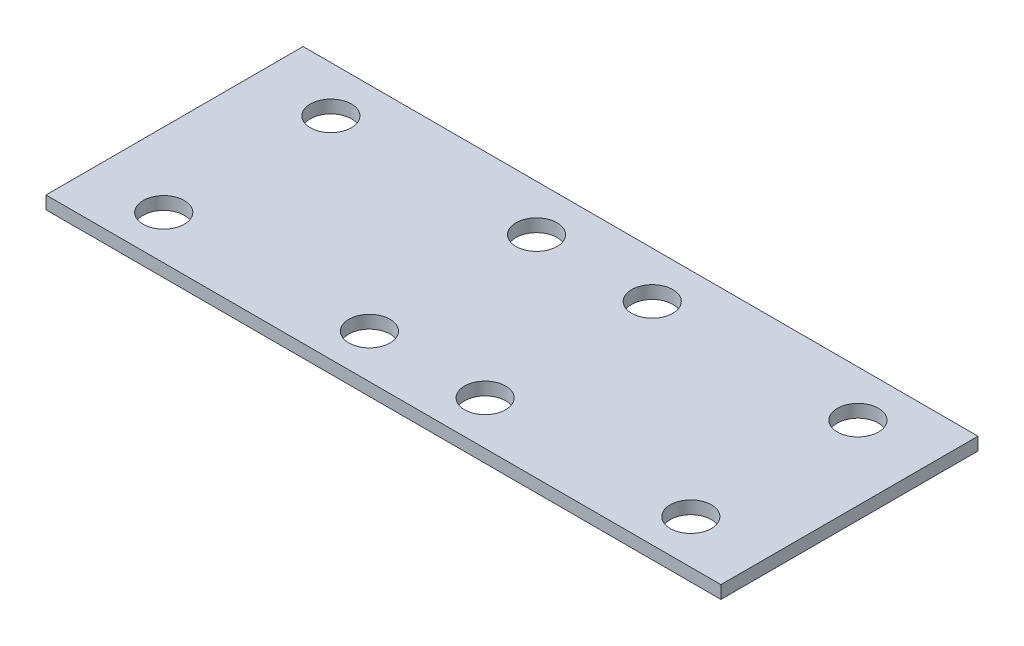
ISO-10303-21;
HEADER;
FILE_DESCRIPTION(('STEP AP214'),'2;1');
FILE_NAME('part.step','',(''),(''),'','','');
FILE_SCHEMA(('AUTOMOTIVE_DESIGN { 1 0 10303 214 1 1 1 1 }'));
ENDSEC;
DATA;
#1=APPLICATION_CONTEXT('core data for automotive mechanical design processes');
#2=APPLICATION_PROTOCOL_DEFINITION('international standard','automotive_design',2000,#1);
#3=PRODUCT_CONTEXT('',#1,'mechanical');
#4=PRODUCT('Part','Part','',(#3));
#5=PRODUCT_RELATED_PRODUCT_CATEGORY('part','',(#4));
#6=PRODUCT_DEFINITION_FORMATION('','',#4);
#7=PRODUCT_DEFINITION_CONTEXT('part definition',#1,'design');
#8=PRODUCT_DEFINITION('design','',#6,#7);
#9=PRODUCT_DEFINITION_SHAPE('','',#8);
#10=(LENGTH_UNIT() NAMED_UNIT(*) SI_UNIT(.MILLI.,.METRE.));
#11=(NAMED_UNIT(*) PLANE_ANGLE_UNIT() SI_UNIT($,.RADIAN.));
#12=(NAMED_UNIT(*) SI_UNIT($,.STERADIAN.) SOLID_ANGLE_UNIT());
#13=UNCERTAINTY_MEASURE_WITH_UNIT(LENGTH_MEASURE(1.E-05),#10,'distance_accuracy_value','');
#14=(GEOMETRIC_REPRESENTATION_CONTEXT(3) GLOBAL_UNCERTAINTY_ASSIGNED_CONTEXT((#13)) GLOBAL_UNIT_ASSIGNED_CONTEXT((#10,
#11,#12)) REPRESENTATION_CONTEXT('',''));
#15=CARTESIAN_POINT('',(0.,0.,0.));
#16=DIRECTION('',(0.,0.,1.));
#17=DIRECTION('',(1.,0.,0.));
#18=AXIS2_PLACEMENT_3D('',#15,#16,#17);
#19=CARTESIAN_POINT('',(26.25,1.,10.));
#20=DIRECTION('',(-1.,0.,0.));
#21=DIRECTION('',(0.,0.,1.));
#22=AXIS2_PLACEMENT_3D('',#19,#20,#21);
#23=PLANE('',#22);
#24=DIRECTION('',(0.,0.,-1.));
#25=VECTOR('',#24,1.);
#26=CARTESIAN_POINT('',(26.25,0.,10.));
#27=LINE('',#26,#25);
#28=CARTESIAN_POINT('',(26.25,0.,10.));
#29=VERTEX_POINT('',#28);
#30=CARTESIAN_POINT('',(26.25,0.,-10.));
#31=VERTEX_POINT('',#30);
#32=EDGE_CURVE('E110',#29,#31,#27,.T.);
#33=ORIENTED_EDGE('',*,*,#32,.T.);
#34=DIRECTION('',(0.,-1.,0.));
#35=VECTOR('',#34,1.);
#36=CARTESIAN_POINT('',(26.25,1.,-10.));
#37=LINE('',#36,#35);
#38=CARTESIAN_POINT('',(26.25,1.,-10.));
#39=VERTEX_POINT('',#38);
#40=EDGE_CURVE('E11',#39,#31,#37,.T.);
#41=ORIENTED_EDGE('',*,*,#40,.F.);
#42=DIRECTION('',(0.,0.,-1.));
#43=VECTOR('',#42,1.);
#44=CARTESIAN_POINT('',(26.25,1.,10.));
#45=LINE('',#44,#43);
#46=CARTESIAN_POINT('',(26.25,1.,10.));
#47=VERTEX_POINT('',#46);
#48=EDGE_CURVE('E93',#47,#39,#45,.T.);
#49=ORIENTED_EDGE('',*,*,#48,.F.);
#50=DIRECTION('',(0.,-1.,0.));
#51=VECTOR('',#50,1.);
#52=CARTESIAN_POINT('',(26.25,1.,10.));
#53=LINE('',#52,#51);
#54=EDGE_CURVE('E106',#47,#29,#53,.T.);
#55=ORIENTED_EDGE('',*,*,#54,.T.);
#56=EDGE_LOOP('',(#33,#41,#49,#55));
#57=FACE_BOUND('',#56,.T.);
#58=ADVANCED_FACE('F39',(#57),#23,.F.);
#59=CARTESIAN_POINT('',(-26.25,1.,-10.));
#60=DIRECTION('',(0.,0.,1.));
#61=DIRECTION('',(1.,0.,0.));
#62=AXIS2_PLACEMENT_3D('',#59,#60,#61);
#63=PLANE('',#62);
#64=DIRECTION('',(-1.,0.,0.));
#65=VECTOR('',#64,1.);
#66=CARTESIAN_POINT('',(-26.25,0.,-10.));
#67=LINE('',#66,#65);
#68=CARTESIAN_POINT('',(-26.25,0.,-10.));
#69=VERTEX_POINT('',#68);
#70=EDGE_CURVE('E98',#31,#69,#67,.T.);
#71=ORIENTED_EDGE('',*,*,#70,.T.);
#72=DIRECTION('',(0.,-1.,0.));
#73=VECTOR('',#72,1.);
#74=CARTESIAN_POINT('',(-26.25,1.,-10.));
#75=LINE('',#74,#73);
#76=CARTESIAN_POINT('',(-26.25,1.,-10.));
#77=VERTEX_POINT('',#76);
#78=EDGE_CURVE('E49',#77,#69,#75,.T.);
#79=ORIENTED_EDGE('',*,*,#78,.F.);
#80=DIRECTION('',(-1.,0.,0.));
#81=VECTOR('',#80,1.);
#82=CARTESIAN_POINT('',(-26.25,1.,-10.));
#83=LINE('',#82,#81);
#84=EDGE_CURVE('E88',#39,#77,#83,.T.);
#85=ORIENTED_EDGE('',*,*,#84,.F.);
#86=ORIENTED_EDGE('',*,*,#40,.T.);
#87=EDGE_LOOP('',(#71,#79,#85,#86));
#88=FACE_BOUND('',#87,.T.);
#89=ADVANCED_FACE('F97',(#88),#63,.F.);
#90=CARTESIAN_POINT('',(-26.25,1.,10.));
#91=DIRECTION('',(1.,0.,0.));
#92=DIRECTION('',(0.,0.,-1.));
#93=AXIS2_PLACEMENT_3D('',#90,#91,#92);
#94=PLANE('',#93);
#95=DIRECTION('',(0.,0.,1.));
#96=VECTOR('',#95,1.);
#97=CARTESIAN_POINT('',(-26.25,0.,10.));
#98=LINE('',#97,#96);
#99=CARTESIAN_POINT('',(-26.25,0.,10.));
#100=VERTEX_POINT('',#99);
#101=EDGE_CURVE('E75',#69,#100,#98,.T.);
#102=ORIENTED_EDGE('',*,*,#101,.T.);
#103=DIRECTION('',(0.,-1.,0.));
#104=VECTOR('',#103,1.);
#105=CARTESIAN_POINT('',(-26.25,1.,10.));
#106=LINE('',#105,#104);
#107=CARTESIAN_POINT('',(-26.25,1.,10.));
#108=VERTEX_POINT('',#107);
#109=EDGE_CURVE('E100',#108,#100,#106,.T.);
#110=ORIENTED_EDGE('',*,*,#109,.F.);
#111=DIRECTION('',(0.,0.,1.));
#112=VECTOR('',#111,1.);
#113=CARTESIAN_POINT('',(-26.25,1.,10.));
#114=LINE('',#113,#112);
#115=EDGE_CURVE('E91',#77,#108,#114,.T.);
#116=ORIENTED_EDGE('',*,*,#115,.F.);
#117=ORIENTED_EDGE('',*,*,#78,.T.);
#118=EDGE_LOOP('',(#102,#110,#116,#117));
#119=FACE_BOUND('',#118,.T.);
#120=ADVANCED_FACE('F102',(#119),#94,.F.);
#121=CARTESIAN_POINT('',(-26.25,1.,10.));
#122=DIRECTION('',(0.,0.,-1.));
#123=DIRECTION('',(-1.,0.,0.));
#124=AXIS2_PLACEMENT_3D('',#121,#122,#123);
#125=PLANE('',#124);
#126=DIRECTION('',(1.,0.,0.));
#127=VECTOR('',#126,1.);
#128=CARTESIAN_POINT('',(-26.25,0.,10.));
#129=LINE('',#128,#127);
#130=EDGE_CURVE('E81',#100,#29,#129,.T.);
#131=ORIENTED_EDGE('',*,*,#130,.T.);
#132=ORIENTED_EDGE('',*,*,#54,.F.);
#133=DIRECTION('',(1.,0.,0.));
#134=VECTOR('',#133,1.);
#135=CARTESIAN_POINT('',(-26.25,1.,10.));
#136=LINE('',#135,#134);
#137=EDGE_CURVE('E58',#108,#47,#136,.T.);
#138=ORIENTED_EDGE('',*,*,#137,.F.);
#139=ORIENTED_EDGE('',*,*,#109,.T.);
#140=EDGE_LOOP('',(#131,#132,#138,#139));
#141=FACE_BOUND('',#140,.T.);
#142=ADVANCED_FACE('F180',(#141),#125,.F.);
#143=CARTESIAN_POINT('',(0.,1.,0.));
#144=DIRECTION('',(0.,-1.,0.));
#145=DIRECTION('',(0.,0.,-1.));
#146=AXIS2_PLACEMENT_3D('',#143,#144,#145);
#147=PLANE('',#146);
#148=CARTESIAN_POINT('',(-20.5,1.,6.59090710382514));
#149=DIRECTION('',(0.,1.,0.));
#150=DIRECTION('',(0.,0.,1.));
#151=AXIS2_PLACEMENT_3D('',#148,#149,#150);
#152=CIRCLE('',#151,1.6);
#153=CARTESIAN_POINT('',(-20.5,1.,8.19090710382514));
#154=VERTEX_POINT('',#153);
#155=EDGE_CURVE('E303',#154,#154,#152,.T.);
#156=ORIENTED_EDGE('',*,*,#155,.F.);
#157=EDGE_LOOP('',(#156));
#158=FACE_BOUND('',#157,.T.);
#159=CARTESIAN_POINT('',(20.5,1.,-6.40909289617486));
#160=DIRECTION('',(0.,1.,0.));
#161=DIRECTION('',(0.,0.,1.));
#162=AXIS2_PLACEMENT_3D('',#159,#160,#161);
#163=CIRCLE('',#162,1.6);
#164=CARTESIAN_POINT('',(20.5,1.,-4.80909289617486));
#165=VERTEX_POINT('',#164);
#166=EDGE_CURVE('E299',#165,#165,#163,.T.);
#167=ORIENTED_EDGE('',*,*,#166,.F.);
#168=EDGE_LOOP('',(#167));
#169=FACE_BOUND('',#168,.T.);
#170=CARTESIAN_POINT('',(4.5,1.,-6.40909289617486));
#171=DIRECTION('',(0.,1.,0.));
#172=DIRECTION('',(0.,0.,1.));
#173=AXIS2_PLACEMENT_3D('',#170,#171,#172);
#174=CIRCLE('',#173,1.6);
#175=CARTESIAN_POINT('',(4.5,1.,-4.80909289617486));
#176=VERTEX_POINT('',#175);
#177=EDGE_CURVE('E302',#176,#176,#174,.T.);
#178=ORIENTED_EDGE('',*,*,#177,.F.);
#179=EDGE_LOOP('',(#178));
#180=FACE_BOUND('',#179,.T.);
#181=CARTESIAN_POINT('',(-4.5,1.,-6.40909289617486));
#182=DIRECTION('',(0.,1.,0.));
#183=DIRECTION('',(0.,0.,1.));
#184=AXIS2_PLACEMENT_3D('',#181,#182,#183);
#185=CIRCLE('',#184,1.6);
#186=CARTESIAN_POINT('',(-4.5,1.,-4.80909289617486));
#187=VERTEX_POINT('',#186);
#188=EDGE_CURVE('E308',#187,#187,#185,.T.);
#189=ORIENTED_EDGE('',*,*,#188,.F.);
#190=EDGE_LOOP('',(#189));
#191=FACE_BOUND('',#190,.T.);
#192=CARTESIAN_POINT('',(-4.5,1.,6.59090710382514));
#193=DIRECTION('',(0.,1.,0.));
#194=DIRECTION('',(0.,0.,1.));
#195=AXIS2_PLACEMENT_3D('',#192,#193,#194);
#196=CIRCLE('',#195,1.6);
#197=CARTESIAN_POINT('',(-4.5,1.,8.19090710382514));
#198=VERTEX_POINT('',#197);
#199=EDGE_CURVE('E311',#198,#198,#196,.T.);
#200=ORIENTED_EDGE('',*,*,#199,.F.);
#201=EDGE_LOOP('',(#200));
#202=FACE_BOUND('',#201,.T.);
#203=CARTESIAN_POINT('',(4.5,1.,6.59090710382514));
#204=DIRECTION('',(0.,1.,0.));
#205=DIRECTION('',(0.,0.,1.));
#206=AXIS2_PLACEMENT_3D('',#203,#204,#205);
#207=CIRCLE('',#206,1.6);
#208=CARTESIAN_POINT('',(4.5,1.,8.19090710382514));
#209=VERTEX_POINT('',#208);
#210=EDGE_CURVE('E336',#209,#209,#207,.T.);
#211=ORIENTED_EDGE('',*,*,#210,.F.);
#212=EDGE_LOOP('',(#211));
#213=FACE_BOUND('',#212,.T.);
#214=CARTESIAN_POINT('',(20.5,1.,6.59090710382514));
#215=DIRECTION('',(0.,1.,0.));
#216=DIRECTION('',(0.,0.,1.));
#217=AXIS2_PLACEMENT_3D('',#214,#215,#216);
#218=CIRCLE('',#217,1.6);
#219=CARTESIAN_POINT('',(20.5,1.,8.19090710382514));
#220=VERTEX_POINT('',#219);
#221=EDGE_CURVE('E314',#220,#220,#218,.T.);
#222=ORIENTED_EDGE('',*,*,#221,.F.);
#223=EDGE_LOOP('',(#222));
#224=FACE_BOUND('',#223,.T.);
#225=CARTESIAN_POINT('',(-20.5,1.,-6.40909289617486));
#226=DIRECTION('',(0.,1.,0.));
#227=DIRECTION('',(0.,0.,1.));
#228=AXIS2_PLACEMENT_3D('',#225,#226,#227);
#229=CIRCLE('',#228,1.6);
#230=CARTESIAN_POINT('',(-20.5,1.,-4.80909289617486));
#231=VERTEX_POINT('',#230);
#232=EDGE_CURVE('E129',#231,#231,#229,.T.);
#233=ORIENTED_EDGE('',*,*,#232,.F.);
#234=EDGE_LOOP('',(#233));
#235=FACE_BOUND('',#234,.T.);
#236=ORIENTED_EDGE('',*,*,#48,.T.);
#237=ORIENTED_EDGE('',*,*,#84,.T.);
#238=ORIENTED_EDGE('',*,*,#115,.T.);
#239=ORIENTED_EDGE('',*,*,#137,.T.);
#240=EDGE_LOOP('',(#236,#237,#238,#239));
#241=FACE_BOUND('',#240,.T.);
#242=ADVANCED_FACE('F89',(#158,#169,#180,#191,#202,#213,#224,#235,#241),#147,.F.);
#243=CARTESIAN_POINT('',(0.,0.,0.));
#244=DIRECTION('',(0.,-1.,0.));
#245=DIRECTION('',(0.,0.,-1.));
#246=AXIS2_PLACEMENT_3D('',#243,#244,#245);
#247=PLANE('',#246);
#248=CARTESIAN_POINT('',(-20.5,0.,6.59090710382514));
#249=DIRECTION('',(0.,-1.,0.));
#250=DIRECTION('',(0.,0.,-1.));
#251=AXIS2_PLACEMENT_3D('',#248,#249,#250);
#252=CIRCLE('',#251,1.6);
#253=CARTESIAN_POINT('',(-20.5,0.,4.99090710382514));
#254=VERTEX_POINT('',#253);
#255=EDGE_CURVE('E42',#254,#254,#252,.T.);
#256=ORIENTED_EDGE('',*,*,#255,.F.);
#257=EDGE_LOOP('',(#256));
#258=FACE_BOUND('',#257,.T.);
#259=CARTESIAN_POINT('',(20.5,0.,-6.40909289617486));
#260=DIRECTION('',(0.,-1.,0.));
#261=DIRECTION('',(0.,0.,-1.));
#262=AXIS2_PLACEMENT_3D('',#259,#260,#261);
#263=CIRCLE('',#262,1.6);
#264=CARTESIAN_POINT('',(20.5,0.,-8.00909289617486));
#265=VERTEX_POINT('',#264);
#266=EDGE_CURVE('E148',#265,#265,#263,.T.);
#267=ORIENTED_EDGE('',*,*,#266,.F.);
#268=EDGE_LOOP('',(#267));
#269=FACE_BOUND('',#268,.T.);
#270=CARTESIAN_POINT('',(4.5,0.,-6.40909289617486));
#271=DIRECTION('',(0.,-1.,0.));
#272=DIRECTION('',(0.,0.,-1.));
#273=AXIS2_PLACEMENT_3D('',#270,#271,#272);
#274=CIRCLE('',#273,1.6);
#275=CARTESIAN_POINT('',(4.5,0.,-8.00909289617486));
#276=VERTEX_POINT('',#275);
#277=EDGE_CURVE('E145',#276,#276,#274,.T.);
#278=ORIENTED_EDGE('',*,*,#277,.F.);
#279=EDGE_LOOP('',(#278));
#280=FACE_BOUND('',#279,.T.);
#281=CARTESIAN_POINT('',(-4.5,0.,-6.40909289617486));
#282=DIRECTION('',(0.,-1.,0.));
#283=DIRECTION('',(0.,0.,-1.));
#284=AXIS2_PLACEMENT_3D('',#281,#282,#283);
#285=CIRCLE('',#284,1.6);
#286=CARTESIAN_POINT('',(-4.5,0.,-8.00909289617486));
#287=VERTEX_POINT('',#286);
#288=EDGE_CURVE('E141',#287,#287,#285,.T.);
#289=ORIENTED_EDGE('',*,*,#288,.F.);
#290=EDGE_LOOP('',(#289));
#291=FACE_BOUND('',#290,.T.);
#292=CARTESIAN_POINT('',(-4.5,0.,6.59090710382514));
#293=DIRECTION('',(0.,-1.,0.));
#294=DIRECTION('',(0.,0.,-1.));
#295=AXIS2_PLACEMENT_3D('',#292,#293,#294);
#296=CIRCLE('',#295,1.6);
#297=CARTESIAN_POINT('',(-4.5,0.,4.99090710382514));
#298=VERTEX_POINT('',#297);
#299=EDGE_CURVE('E137',#298,#298,#296,.T.);
#300=ORIENTED_EDGE('',*,*,#299,.F.);
#301=EDGE_LOOP('',(#300));
#302=FACE_BOUND('',#301,.T.);
#303=CARTESIAN_POINT('',(4.5,0.,6.59090710382514));
#304=DIRECTION('',(0.,-1.,0.));
#305=DIRECTION('',(0.,0.,-1.));
#306=AXIS2_PLACEMENT_3D('',#303,#304,#305);
#307=CIRCLE('',#306,1.6);
#308=CARTESIAN_POINT('',(4.5,0.,4.99090710382514));
#309=VERTEX_POINT('',#308);
#310=EDGE_CURVE('E133',#309,#309,#307,.T.);
#311=ORIENTED_EDGE('',*,*,#310,.F.);
#312=EDGE_LOOP('',(#311));
#313=FACE_BOUND('',#312,.T.);
#314=CARTESIAN_POINT('',(20.5,0.,6.59090710382514));
#315=DIRECTION('',(0.,-1.,0.));
#316=DIRECTION('',(0.,0.,-1.));
#317=AXIS2_PLACEMENT_3D('',#314,#315,#316);
#318=CIRCLE('',#317,1.6);
#319=CARTESIAN_POINT('',(20.5,0.,4.99090710382514));
#320=VERTEX_POINT('',#319);
#321=EDGE_CURVE('E128',#320,#320,#318,.T.);
#322=ORIENTED_EDGE('',*,*,#321,.F.);
#323=EDGE_LOOP('',(#322));
#324=FACE_BOUND('',#323,.T.);
#325=CARTESIAN_POINT('',(-20.5,0.,-6.40909289617486));
#326=DIRECTION('',(0.,-1.,0.));
#327=DIRECTION('',(0.,0.,-1.));
#328=AXIS2_PLACEMENT_3D('',#325,#326,#327);
#329=CIRCLE('',#328,1.6);
#330=CARTESIAN_POINT('',(-20.5,0.,-8.00909289617486));
#331=VERTEX_POINT('',#330);
#332=EDGE_CURVE('E124',#331,#331,#329,.T.);
#333=ORIENTED_EDGE('',*,*,#332,.F.);
#334=EDGE_LOOP('',(#333));
#335=FACE_BOUND('',#334,.T.);
#336=ORIENTED_EDGE('',*,*,#32,.F.);
#337=ORIENTED_EDGE('',*,*,#130,.F.);
#338=ORIENTED_EDGE('',*,*,#101,.F.);
#339=ORIENTED_EDGE('',*,*,#70,.F.);
#340=EDGE_LOOP('',(#336,#337,#338,#339));
#341=FACE_BOUND('',#340,.T.);
#342=ADVANCED_FACE('F160',(#258,#269,#280,#291,#302,#313,#324,#335,#341),#247,.T.);
#343=CARTESIAN_POINT('',(-20.5,-1.,-6.40909289617486));
#344=DIRECTION('',(0.,1.,0.));
#345=DIRECTION('',(0.,0.,1.));
#346=AXIS2_PLACEMENT_3D('',#343,#344,#345);
#347=CYLINDRICAL_SURFACE('',#346,1.6);
#348=ORIENTED_EDGE('',*,*,#332,.T.);
#349=EDGE_LOOP('',(#348));
#350=FACE_BOUND('',#349,.T.);
#351=ORIENTED_EDGE('',*,*,#232,.T.);
#352=EDGE_LOOP('',(#351));
#353=FACE_BOUND('',#352,.T.);
#354=ADVANCED_FACE('F163',(#350,#353),#347,.F.);
#355=CARTESIAN_POINT('',(20.5,-1.,6.59090710382514));
#356=DIRECTION('',(0.,1.,0.));
#357=DIRECTION('',(0.,0.,1.));
#358=AXIS2_PLACEMENT_3D('',#355,#356,#357);
#359=CYLINDRICAL_SURFACE('',#358,1.6);
#360=ORIENTED_EDGE('',*,*,#321,.T.);
#361=EDGE_LOOP('',(#360));
#362=FACE_BOUND('',#361,.T.);
#363=ORIENTED_EDGE('',*,*,#221,.T.);
#364=EDGE_LOOP('',(#363));
#365=FACE_BOUND('',#364,.T.);
#366=ADVANCED_FACE('F225',(#362,#365),#359,.F.);
#367=CARTESIAN_POINT('',(4.5,-1.,6.59090710382514));
#368=DIRECTION('',(0.,1.,0.));
#369=DIRECTION('',(0.,0.,1.));
#370=AXIS2_PLACEMENT_3D('',#367,#368,#369);
#371=CYLINDRICAL_SURFACE('',#370,1.6);
#372=ORIENTED_EDGE('',*,*,#310,.T.);
#373=EDGE_LOOP('',(#372));
#374=FACE_BOUND('',#373,.T.);
#375=ORIENTED_EDGE('',*,*,#210,.T.);
#376=EDGE_LOOP('',(#375));
#377=FACE_BOUND('',#376,.T.);
#378=ADVANCED_FACE('F235',(#374,#377),#371,.F.);
#379=CARTESIAN_POINT('',(-4.5,-1.,6.59090710382514));
#380=DIRECTION('',(0.,1.,0.));
#381=DIRECTION('',(0.,0.,1.));
#382=AXIS2_PLACEMENT_3D('',#379,#380,#381);
#383=CYLINDRICAL_SURFACE('',#382,1.6);
#384=ORIENTED_EDGE('',*,*,#299,.T.);
#385=EDGE_LOOP('',(#384));
#386=FACE_BOUND('',#385,.T.);
#387=ORIENTED_EDGE('',*,*,#199,.T.);
#388=EDGE_LOOP('',(#387));
#389=FACE_BOUND('',#388,.T.);
#390=ADVANCED_FACE('F245',(#386,#389),#383,.F.);
#391=CARTESIAN_POINT('',(-4.5,-1.,-6.40909289617486));
#392=DIRECTION('',(0.,1.,0.));
#393=DIRECTION('',(0.,0.,1.));
#394=AXIS2_PLACEMENT_3D('',#391,#392,#393);
#395=CYLINDRICAL_SURFACE('',#394,1.6);
#396=ORIENTED_EDGE('',*,*,#288,.T.);
#397=EDGE_LOOP('',(#396));
#398=FACE_BOUND('',#397,.T.);
#399=ORIENTED_EDGE('',*,*,#188,.T.);
#400=EDGE_LOOP('',(#399));
#401=FACE_BOUND('',#400,.T.);
#402=ADVANCED_FACE('F255',(#398,#401),#395,.F.);
#403=CARTESIAN_POINT('',(4.5,-1.,-6.40909289617486));
#404=DIRECTION('',(0.,1.,0.));
#405=DIRECTION('',(0.,0.,1.));
#406=AXIS2_PLACEMENT_3D('',#403,#404,#405);
#407=CYLINDRICAL_SURFACE('',#406,1.6);
#408=ORIENTED_EDGE('',*,*,#277,.T.);
#409=EDGE_LOOP('',(#408));
#410=FACE_BOUND('',#409,.T.);
#411=ORIENTED_EDGE('',*,*,#177,.T.);
#412=EDGE_LOOP('',(#411));
#413=FACE_BOUND('',#412,.T.);
#414=ADVANCED_FACE('F265',(#410,#413),#407,.F.);
#415=CARTESIAN_POINT('',(20.5,-1.,-6.40909289617486));
#416=DIRECTION('',(0.,1.,0.));
#417=DIRECTION('',(0.,0.,1.));
#418=AXIS2_PLACEMENT_3D('',#415,#416,#417);
#419=CYLINDRICAL_SURFACE('',#418,1.6);
#420=ORIENTED_EDGE('',*,*,#266,.T.);
#421=EDGE_LOOP('',(#420));
#422=FACE_BOUND('',#421,.T.);
#423=ORIENTED_EDGE('',*,*,#166,.T.);
#424=EDGE_LOOP('',(#423));
#425=FACE_BOUND('',#424,.T.);
#426=ADVANCED_FACE('F275',(#422,#425),#419,.F.);
#427=CARTESIAN_POINT('',(-20.5,-1.,6.59090710382514));
#428=DIRECTION('',(0.,1.,0.));
#429=DIRECTION('',(0.,0.,1.));
#430=AXIS2_PLACEMENT_3D('',#427,#428,#429);
#431=CYLINDRICAL_SURFACE('',#430,1.6);
#432=ORIENTED_EDGE('',*,*,#255,.T.);
#433=EDGE_LOOP('',(#432));
#434=FACE_BOUND('',#433,.T.);
#435=ORIENTED_EDGE('',*,*,#155,.T.);
#436=EDGE_LOOP('',(#435));
#437=FACE_BOUND('',#436,.T.);
#438=ADVANCED_FACE('F157',(#434,#437),#431,.F.);
#439=CLOSED_SHELL('',(#58,#89,#120,#142,#242,#342,#354,#366,#378,#390,#402,#414,#426,#438));
#440=MANIFOLD_SOLID_BREP('B2',#439);
#441=ADVANCED_BREP_SHAPE_REPRESENTATION('',(#18,#440),#14);
#442=SHAPE_DEFINITION_REPRESENTATION(#9,#441);
ENDSEC;
END-ISO-10303-21;
